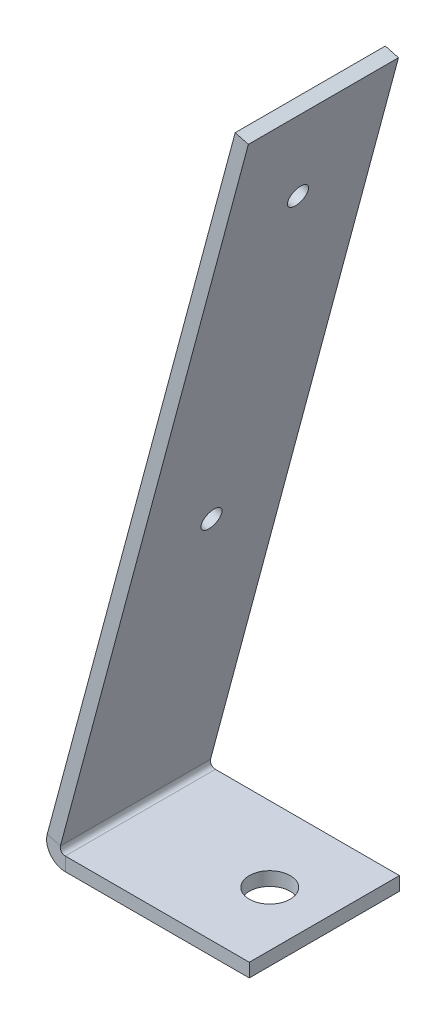
ISO-10303-21;
HEADER;
FILE_DESCRIPTION(('STEP AP214'),'2;1');
FILE_NAME('part.step','',(''),(''),'','','');
FILE_SCHEMA(('AUTOMOTIVE_DESIGN { 1 0 10303 214 1 1 1 1 }'));
ENDSEC;
DATA;
#1=APPLICATION_CONTEXT('core data for automotive mechanical design processes');
#2=APPLICATION_PROTOCOL_DEFINITION('international standard','automotive_design',2000,#1);
#3=PRODUCT_CONTEXT('',#1,'mechanical');
#4=PRODUCT('Part','Part','',(#3));
#5=PRODUCT_RELATED_PRODUCT_CATEGORY('part','',(#4));
#6=PRODUCT_DEFINITION_FORMATION('','',#4);
#7=PRODUCT_DEFINITION_CONTEXT('part definition',#1,'design');
#8=PRODUCT_DEFINITION('design','',#6,#7);
#9=PRODUCT_DEFINITION_SHAPE('','',#8);
#10=(LENGTH_UNIT() NAMED_UNIT(*) SI_UNIT(.MILLI.,.METRE.));
#11=(NAMED_UNIT(*) PLANE_ANGLE_UNIT() SI_UNIT($,.RADIAN.));
#12=(NAMED_UNIT(*) SI_UNIT($,.STERADIAN.) SOLID_ANGLE_UNIT());
#13=UNCERTAINTY_MEASURE_WITH_UNIT(LENGTH_MEASURE(1.E-05),#10,'distance_accuracy_value','');
#14=(GEOMETRIC_REPRESENTATION_CONTEXT(3) GLOBAL_UNCERTAINTY_ASSIGNED_CONTEXT((#13)) GLOBAL_UNIT_ASSIGNED_CONTEXT((#10,
#11,#12)) REPRESENTATION_CONTEXT('',''));
#15=CARTESIAN_POINT('',(0.,0.,0.));
#16=DIRECTION('',(0.,0.,1.));
#17=DIRECTION('',(1.,0.,0.));
#18=AXIS2_PLACEMENT_3D('',#15,#16,#17);
#19=CARTESIAN_POINT('',(0.,-2.,11.));
#20=DIRECTION('',(0.,0.,1.));
#21=DIRECTION('',(1.,0.,0.));
#22=AXIS2_PLACEMENT_3D('',#19,#20,#21);
#23=PLANE('',#22);
#24=DIRECTION('',(1.,0.,0.));
#25=VECTOR('',#24,1.);
#26=CARTESIAN_POINT('',(0.,0.,11.));
#27=LINE('',#26,#25);
#28=CARTESIAN_POINT('',(-26.969491829545,0.,11.));
#29=VERTEX_POINT('',#28);
#30=CARTESIAN_POINT('',(0.,0.,11.));
#31=VERTEX_POINT('',#30);
#32=EDGE_CURVE('E92',#29,#31,#27,.T.);
#33=ORIENTED_EDGE('',*,*,#32,.F.);
#34=DIRECTION('',(0.,-1.,0.));
#35=VECTOR('',#34,1.);
#36=CARTESIAN_POINT('',(-26.969491829545,0.,11.));
#37=LINE('',#36,#35);
#38=CARTESIAN_POINT('',(-26.969491829545,-2.00000000000001,11.));
#39=VERTEX_POINT('',#38);
#40=EDGE_CURVE('E108',#29,#39,#37,.T.);
#41=ORIENTED_EDGE('',*,*,#40,.T.);
#42=DIRECTION('',(1.,0.,0.));
#43=VECTOR('',#42,1.);
#44=CARTESIAN_POINT('',(0.,-2.,11.));
#45=LINE('',#44,#43);
#46=CARTESIAN_POINT('',(0.,-2.,11.));
#47=VERTEX_POINT('',#46);
#48=EDGE_CURVE('E81',#39,#47,#45,.T.);
#49=ORIENTED_EDGE('',*,*,#48,.T.);
#50=DIRECTION('',(0.,1.,0.));
#51=VECTOR('',#50,1.);
#52=CARTESIAN_POINT('',(0.,-2.,11.));
#53=LINE('',#52,#51);
#54=EDGE_CURVE('E13',#47,#31,#53,.T.);
#55=ORIENTED_EDGE('',*,*,#54,.T.);
#56=EDGE_LOOP('',(#33,#41,#49,#55));
#57=FACE_BOUND('',#56,.T.);
#58=ADVANCED_FACE('F58',(#57),#23,.T.);
#59=CARTESIAN_POINT('',(0.,-2.,0.));
#60=DIRECTION('',(0.,1.,0.));
#61=DIRECTION('',(0.,0.,1.));
#62=AXIS2_PLACEMENT_3D('',#59,#60,#61);
#63=PLANE('',#62);
#64=CARTESIAN_POINT('',(-8.,-2.00000000000001,0.));
#65=DIRECTION('',(0.,1.,0.));
#66=DIRECTION('',(0.,0.,1.));
#67=AXIS2_PLACEMENT_3D('',#64,#65,#66);
#68=CIRCLE('',#67,3.);
#69=CARTESIAN_POINT('',(-8.,-2.00000000000001,3.));
#70=VERTEX_POINT('',#69);
#71=EDGE_CURVE('E138',#70,#70,#68,.T.);
#72=ORIENTED_EDGE('',*,*,#71,.T.);
#73=EDGE_LOOP('',(#72));
#74=FACE_BOUND('',#73,.T.);
#75=DIRECTION('',(0.,0.,1.));
#76=VECTOR('',#75,1.);
#77=CARTESIAN_POINT('',(-26.969491829545,-2.00000000000001,11.));
#78=LINE('',#77,#76);
#79=CARTESIAN_POINT('',(-26.969491829545,-2.,-11.));
#80=VERTEX_POINT('',#79);
#81=EDGE_CURVE('E129',#39,#80,#78,.F.);
#82=ORIENTED_EDGE('',*,*,#81,.T.);
#83=DIRECTION('',(-1.,0.,0.));
#84=VECTOR('',#83,1.);
#85=CARTESIAN_POINT('',(0.,-2.,-11.));
#86=LINE('',#85,#84);
#87=CARTESIAN_POINT('',(0.,-2.,-11.));
#88=VERTEX_POINT('',#87);
#89=EDGE_CURVE('E112',#88,#80,#86,.T.);
#90=ORIENTED_EDGE('',*,*,#89,.F.);
#91=DIRECTION('',(0.,0.,-1.));
#92=VECTOR('',#91,1.);
#93=CARTESIAN_POINT('',(0.,-2.,11.));
#94=LINE('',#93,#92);
#95=EDGE_CURVE('E97',#47,#88,#94,.T.);
#96=ORIENTED_EDGE('',*,*,#95,.F.);
#97=ORIENTED_EDGE('',*,*,#48,.F.);
#98=EDGE_LOOP('',(#82,#90,#96,#97));
#99=FACE_BOUND('',#98,.T.);
#100=ADVANCED_FACE('F239',(#74,#99),#63,.F.);
#101=CARTESIAN_POINT('',(0.,0.,0.));
#102=DIRECTION('',(0.,1.,0.));
#103=DIRECTION('',(0.,0.,1.));
#104=AXIS2_PLACEMENT_3D('',#101,#102,#103);
#105=PLANE('',#104);
#106=CARTESIAN_POINT('',(-8.,0.,0.));
#107=DIRECTION('',(0.,1.,0.));
#108=DIRECTION('',(0.,0.,1.));
#109=AXIS2_PLACEMENT_3D('',#106,#107,#108);
#110=CIRCLE('',#109,3.);
#111=CARTESIAN_POINT('',(-8.,0.,3.));
#112=VERTEX_POINT('',#111);
#113=EDGE_CURVE('E172',#112,#112,#110,.T.);
#114=ORIENTED_EDGE('',*,*,#113,.F.);
#115=EDGE_LOOP('',(#114));
#116=FACE_BOUND('',#115,.T.);
#117=DIRECTION('',(-1.,0.,0.));
#118=VECTOR('',#117,1.);
#119=CARTESIAN_POINT('',(0.,0.,-11.));
#120=LINE('',#119,#118);
#121=CARTESIAN_POINT('',(0.,0.,-11.));
#122=VERTEX_POINT('',#121);
#123=CARTESIAN_POINT('',(-26.969491829545,0.,-11.));
#124=VERTEX_POINT('',#123);
#125=EDGE_CURVE('E98',#122,#124,#120,.T.);
#126=ORIENTED_EDGE('',*,*,#125,.T.);
#127=DIRECTION('',(0.,0.,1.));
#128=VECTOR('',#127,1.);
#129=CARTESIAN_POINT('',(-26.969491829545,0.,11.));
#130=LINE('',#129,#128);
#131=EDGE_CURVE('E73',#29,#124,#130,.F.);
#132=ORIENTED_EDGE('',*,*,#131,.F.);
#133=ORIENTED_EDGE('',*,*,#32,.T.);
#134=DIRECTION('',(0.,0.,-1.));
#135=VECTOR('',#134,1.);
#136=CARTESIAN_POINT('',(0.,0.,11.));
#137=LINE('',#136,#135);
#138=EDGE_CURVE('E95',#31,#122,#137,.T.);
#139=ORIENTED_EDGE('',*,*,#138,.T.);
#140=EDGE_LOOP('',(#126,#132,#133,#139));
#141=FACE_BOUND('',#140,.T.);
#142=ADVANCED_FACE('F93',(#116,#141),#105,.T.);
#143=CARTESIAN_POINT('',(0.,-2.,11.));
#144=DIRECTION('',(1.,0.,0.));
#145=DIRECTION('',(0.,0.,-1.));
#146=AXIS2_PLACEMENT_3D('',#143,#144,#145);
#147=PLANE('',#146);
#148=ORIENTED_EDGE('',*,*,#138,.F.);
#149=ORIENTED_EDGE('',*,*,#54,.F.);
#150=ORIENTED_EDGE('',*,*,#95,.T.);
#151=DIRECTION('',(0.,1.,0.));
#152=VECTOR('',#151,1.);
#153=CARTESIAN_POINT('',(0.,-2.,-11.));
#154=LINE('',#153,#152);
#155=EDGE_CURVE('E62',#88,#122,#154,.T.);
#156=ORIENTED_EDGE('',*,*,#155,.T.);
#157=EDGE_LOOP('',(#148,#149,#150,#156));
#158=FACE_BOUND('',#157,.T.);
#159=ADVANCED_FACE('F60',(#158),#147,.T.);
#160=CARTESIAN_POINT('',(0.,-2.,-11.));
#161=DIRECTION('',(0.,0.,-1.));
#162=DIRECTION('',(-1.,0.,0.));
#163=AXIS2_PLACEMENT_3D('',#160,#161,#162);
#164=PLANE('',#163);
#165=DIRECTION('',(0.,-1.,0.));
#166=VECTOR('',#165,1.);
#167=CARTESIAN_POINT('',(-26.969491829545,0.,-11.));
#168=LINE('',#167,#166);
#169=EDGE_CURVE('E104',#124,#80,#168,.T.);
#170=ORIENTED_EDGE('',*,*,#169,.F.);
#171=ORIENTED_EDGE('',*,*,#125,.F.);
#172=ORIENTED_EDGE('',*,*,#155,.F.);
#173=ORIENTED_EDGE('',*,*,#89,.T.);
#174=EDGE_LOOP('',(#170,#171,#172,#173));
#175=FACE_BOUND('',#174,.T.);
#176=ADVANCED_FACE('F241',(#175),#164,.T.);
#177=CARTESIAN_POINT('',(-26.969491829545,0.7366,-11.));
#178=DIRECTION('',(0.,0.,-1.));
#179=DIRECTION('',(0.,1.,0.));
#180=AXIS2_PLACEMENT_3D('',#177,#178,#179);
#181=PLANE('',#180);
#182=DIRECTION('',(0.965925826289069,-0.258819045102518,0.));
#183=VECTOR('',#182,1.);
#184=CARTESIAN_POINT('',(-29.6128444457677,1.44488419882755,-11.));
#185=LINE('',#184,#183);
#186=CARTESIAN_POINT('',(-27.6809927931895,0.927246108622515,-11.));
#187=VERTEX_POINT('',#186);
#188=CARTESIAN_POINT('',(-29.6128444457677,1.44488419882755,-11.));
#189=VERTEX_POINT('',#188);
#190=EDGE_CURVE('E134',#187,#189,#185,.F.);
#191=ORIENTED_EDGE('',*,*,#190,.F.);
#192=CARTESIAN_POINT('',(-26.969491829545,0.7366,-11.));
#193=DIRECTION('',(0.,0.,1.));
#194=DIRECTION('',(0.,-1.,0.));
#195=AXIS2_PLACEMENT_3D('',#192,#193,#194);
#196=CIRCLE('',#195,0.736600000000001);
#197=EDGE_CURVE('E123',#124,#187,#196,.F.);
#198=ORIENTED_EDGE('',*,*,#197,.F.);
#199=ORIENTED_EDGE('',*,*,#169,.T.);
#200=CARTESIAN_POINT('',(-26.969491829545,0.7366,-11.));
#201=DIRECTION('',(0.,0.,1.));
#202=DIRECTION('',(0.,-1.,0.));
#203=AXIS2_PLACEMENT_3D('',#200,#201,#202);
#204=CIRCLE('',#203,2.7366);
#205=EDGE_CURVE('E116',#80,#189,#204,.F.);
#206=ORIENTED_EDGE('',*,*,#205,.T.);
#207=EDGE_LOOP('',(#191,#198,#199,#206));
#208=FACE_BOUND('',#207,.T.);
#209=ADVANCED_FACE('F244',(#208),#181,.T.);
#210=CARTESIAN_POINT('',(-26.969491829545,0.736599999999995,11.));
#211=DIRECTION('',(0.,0.,-1.));
#212=DIRECTION('',(0.,1.,0.));
#213=AXIS2_PLACEMENT_3D('',#210,#211,#212);
#214=PLANE('',#213);
#215=CARTESIAN_POINT('',(-26.969491829545,0.736599999999995,11.));
#216=DIRECTION('',(0.,0.,1.));
#217=DIRECTION('',(0.,-1.,0.));
#218=AXIS2_PLACEMENT_3D('',#215,#216,#217);
#219=CIRCLE('',#218,0.736600000000001);
#220=CARTESIAN_POINT('',(-27.6809927931895,0.92724610862251,11.));
#221=VERTEX_POINT('',#220);
#222=EDGE_CURVE('E118',#221,#29,#219,.T.);
#223=ORIENTED_EDGE('',*,*,#222,.F.);
#224=DIRECTION('',(0.965925826289069,-0.258819045102518,0.));
#225=VECTOR('',#224,1.);
#226=CARTESIAN_POINT('',(-27.6809927931895,0.927246108622509,11.));
#227=LINE('',#226,#225);
#228=CARTESIAN_POINT('',(-29.6128444457677,1.44488419882755,11.));
#229=VERTEX_POINT('',#228);
#230=EDGE_CURVE('E141',#221,#229,#227,.F.);
#231=ORIENTED_EDGE('',*,*,#230,.T.);
#232=CARTESIAN_POINT('',(-26.969491829545,0.736599999999995,11.));
#233=DIRECTION('',(0.,0.,1.));
#234=DIRECTION('',(0.,-1.,0.));
#235=AXIS2_PLACEMENT_3D('',#232,#233,#234);
#236=CIRCLE('',#235,2.7366);
#237=EDGE_CURVE('E126',#229,#39,#236,.T.);
#238=ORIENTED_EDGE('',*,*,#237,.T.);
#239=ORIENTED_EDGE('',*,*,#40,.F.);
#240=EDGE_LOOP('',(#223,#231,#238,#239));
#241=FACE_BOUND('',#240,.T.);
#242=ADVANCED_FACE('F248',(#241),#214,.F.);
#243=CARTESIAN_POINT('',(-26.969491829545,0.736599999999995,11.));
#244=DIRECTION('',(0.,0.,1.));
#245=DIRECTION('',(-0.965925826289069,0.258819045102518,0.));
#246=AXIS2_PLACEMENT_3D('',#243,#244,#245);
#247=CYLINDRICAL_SURFACE('',#246,2.7366);
#248=ORIENTED_EDGE('',*,*,#81,.F.);
#249=ORIENTED_EDGE('',*,*,#237,.F.);
#250=DIRECTION('',(0.,0.,1.));
#251=VECTOR('',#250,1.);
#252=CARTESIAN_POINT('',(-29.6128444457677,1.44488419882755,-11.));
#253=LINE('',#252,#251);
#254=EDGE_CURVE('E144',#229,#189,#253,.F.);
#255=ORIENTED_EDGE('',*,*,#254,.T.);
#256=ORIENTED_EDGE('',*,*,#205,.F.);
#257=EDGE_LOOP('',(#248,#249,#255,#256));
#258=FACE_BOUND('',#257,.T.);
#259=ADVANCED_FACE('F245',(#258),#247,.T.);
#260=CARTESIAN_POINT('',(-26.969491829545,0.736599999999995,11.));
#261=DIRECTION('',(0.,0.,1.));
#262=DIRECTION('',(-0.965925826289069,0.258819045102518,0.));
#263=AXIS2_PLACEMENT_3D('',#260,#261,#262);
#264=CYLINDRICAL_SURFACE('',#263,0.736600000000001);
#265=ORIENTED_EDGE('',*,*,#131,.T.);
#266=ORIENTED_EDGE('',*,*,#197,.T.);
#267=DIRECTION('',(0.,0.,1.));
#268=VECTOR('',#267,1.);
#269=CARTESIAN_POINT('',(-27.6809927931895,0.927246108622513,-11.));
#270=LINE('',#269,#268);
#271=EDGE_CURVE('E137',#187,#221,#270,.T.);
#272=ORIENTED_EDGE('',*,*,#271,.T.);
#273=ORIENTED_EDGE('',*,*,#222,.T.);
#274=EDGE_LOOP('',(#265,#266,#272,#273));
#275=FACE_BOUND('',#274,.T.);
#276=ADVANCED_FACE('F247',(#275),#264,.F.);
#277=CARTESIAN_POINT('',(-2.06580342358527,104.251840891798,11.));
#278=DIRECTION('',(0.,0.,-1.));
#279=DIRECTION('',(-1.,0.,0.));
#280=AXIS2_PLACEMENT_3D('',#277,#278,#279);
#281=PLANE('',#280);
#282=ORIENTED_EDGE('',*,*,#230,.F.);
#283=DIRECTION('',(-0.258819045102518,-0.965925826289069,0.));
#284=VECTOR('',#283,1.);
#285=CARTESIAN_POINT('',(-0.133951771007131,103.734202801593,11.));
#286=LINE('',#285,#284);
#287=CARTESIAN_POINT('',(-0.13395177100713,103.734202801593,11.));
#288=VERTEX_POINT('',#287);
#289=EDGE_CURVE('E147',#221,#288,#286,.F.);
#290=ORIENTED_EDGE('',*,*,#289,.T.);
#291=DIRECTION('',(0.965925826289069,-0.258819045102518,0.));
#292=VECTOR('',#291,1.);
#293=CARTESIAN_POINT('',(-2.06580342358527,104.251840891798,11.));
#294=LINE('',#293,#292);
#295=CARTESIAN_POINT('',(-2.06580342358527,104.251840891798,11.));
#296=VERTEX_POINT('',#295);
#297=EDGE_CURVE('E121',#296,#288,#294,.T.);
#298=ORIENTED_EDGE('',*,*,#297,.F.);
#299=DIRECTION('',(0.258819045102518,0.965925826289069,0.));
#300=VECTOR('',#299,1.);
#301=CARTESIAN_POINT('',(-27.8516803485246,8.01763809020496,11.));
#302=LINE('',#301,#300);
#303=EDGE_CURVE('E156',#229,#296,#302,.T.);
#304=ORIENTED_EDGE('',*,*,#303,.F.);
#305=EDGE_LOOP('',(#282,#290,#298,#304));
#306=FACE_BOUND('',#305,.T.);
#307=ADVANCED_FACE('F212',(#306),#281,.F.);
#308=CARTESIAN_POINT('',(-29.861299291758,0.517638090205035,-11.));
#309=DIRECTION('',(0.,0.,1.));
#310=DIRECTION('',(1.,0.,0.));
#311=AXIS2_PLACEMENT_3D('',#308,#309,#310);
#312=PLANE('',#311);
#313=ORIENTED_EDGE('',*,*,#190,.T.);
#314=DIRECTION('',(-0.258819045102518,-0.965925826289069,0.));
#315=VECTOR('',#314,1.);
#316=CARTESIAN_POINT('',(-27.8516803485246,8.01763809020496,-11.));
#317=LINE('',#316,#315);
#318=CARTESIAN_POINT('',(-2.06580342358527,104.251840891798,-11.));
#319=VERTEX_POINT('',#318);
#320=EDGE_CURVE('E162',#319,#189,#317,.T.);
#321=ORIENTED_EDGE('',*,*,#320,.F.);
#322=DIRECTION('',(0.965925826289069,-0.258819045102518,0.));
#323=VECTOR('',#322,1.);
#324=CARTESIAN_POINT('',(-2.06580342358527,104.251840891798,-11.));
#325=LINE('',#324,#323);
#326=CARTESIAN_POINT('',(-0.13395177100713,103.734202801593,-11.));
#327=VERTEX_POINT('',#326);
#328=EDGE_CURVE('E165',#319,#327,#325,.T.);
#329=ORIENTED_EDGE('',*,*,#328,.T.);
#330=DIRECTION('',(0.258819045102518,0.965925826289069,0.));
#331=VECTOR('',#330,1.);
#332=CARTESIAN_POINT('',(-27.9294476391798,0.,-11.));
#333=LINE('',#332,#331);
#334=EDGE_CURVE('E153',#327,#187,#333,.F.);
#335=ORIENTED_EDGE('',*,*,#334,.T.);
#336=EDGE_LOOP('',(#313,#321,#329,#335));
#337=FACE_BOUND('',#336,.T.);
#338=ADVANCED_FACE('F194',(#337),#312,.F.);
#339=CARTESIAN_POINT('',(-27.8516803485246,8.01763809020496,0.));
#340=DIRECTION('',(0.965925826289069,-0.258819045102518,0.));
#341=DIRECTION('',(0.258819045102518,0.965925826289069,0.));
#342=AXIS2_PLACEMENT_3D('',#339,#340,#341);
#343=PLANE('',#342);
#344=CARTESIAN_POINT('',(-5.79279767306154,90.342508993235,0.));
#345=DIRECTION('',(-0.965925826289069,0.258819045102518,0.));
#346=DIRECTION('',(-0.258819045102518,-0.965925826289069,0.));
#347=AXIS2_PLACEMENT_3D('',#344,#345,#346);
#348=CIRCLE('',#347,1.5);
#349=CARTESIAN_POINT('',(-6.18102624071531,88.8936202538014,0.));
#350=VERTEX_POINT('',#349);
#351=EDGE_CURVE('E184',#350,#350,#348,.T.);
#352=ORIENTED_EDGE('',*,*,#351,.F.);
#353=EDGE_LOOP('',(#352));
#354=FACE_BOUND('',#353,.T.);
#355=CARTESIAN_POINT('',(-18.4749308830849,43.0121435050706,0.));
#356=DIRECTION('',(-0.965925826289069,0.258819045102518,0.));
#357=DIRECTION('',(-0.258819045102518,-0.965925826289069,0.));
#358=AXIS2_PLACEMENT_3D('',#355,#356,#357);
#359=CIRCLE('',#358,1.5);
#360=CARTESIAN_POINT('',(-18.8631594507387,41.563254765637,0.));
#361=VERTEX_POINT('',#360);
#362=EDGE_CURVE('E178',#361,#361,#359,.T.);
#363=ORIENTED_EDGE('',*,*,#362,.F.);
#364=EDGE_LOOP('',(#363));
#365=FACE_BOUND('',#364,.T.);
#366=ORIENTED_EDGE('',*,*,#254,.F.);
#367=ORIENTED_EDGE('',*,*,#303,.T.);
#368=DIRECTION('',(0.,0.,-1.));
#369=VECTOR('',#368,1.);
#370=CARTESIAN_POINT('',(-2.06580342358527,104.251840891798,0.));
#371=LINE('',#370,#369);
#372=EDGE_CURVE('E159',#296,#319,#371,.T.);
#373=ORIENTED_EDGE('',*,*,#372,.T.);
#374=ORIENTED_EDGE('',*,*,#320,.T.);
#375=EDGE_LOOP('',(#366,#367,#373,#374));
#376=FACE_BOUND('',#375,.T.);
#377=ADVANCED_FACE('F190',(#354,#365,#376),#343,.F.);
#378=CARTESIAN_POINT('',(-25.9198286959465,7.49999999999993,0.));
#379=DIRECTION('',(0.965925826289069,-0.258819045102518,0.));
#380=DIRECTION('',(0.258819045102518,0.965925826289069,0.));
#381=AXIS2_PLACEMENT_3D('',#378,#379,#380);
#382=PLANE('',#381);
#383=CARTESIAN_POINT('',(-3.86094602048338,89.82487090303,0.));
#384=DIRECTION('',(0.965925826289069,-0.258819045102518,0.));
#385=DIRECTION('',(0.258819045102518,0.965925826289069,0.));
#386=AXIS2_PLACEMENT_3D('',#383,#384,#385);
#387=CIRCLE('',#386,1.5);
#388=CARTESIAN_POINT('',(-3.47271745282961,91.2737596424636,0.));
#389=VERTEX_POINT('',#388);
#390=EDGE_CURVE('E181',#389,#389,#387,.T.);
#391=ORIENTED_EDGE('',*,*,#390,.F.);
#392=EDGE_LOOP('',(#391));
#393=FACE_BOUND('',#392,.T.);
#394=CARTESIAN_POINT('',(-16.5430792305068,42.4945054148656,0.));
#395=DIRECTION('',(0.965925826289069,-0.258819045102518,0.));
#396=DIRECTION('',(0.258819045102518,0.965925826289069,0.));
#397=AXIS2_PLACEMENT_3D('',#394,#395,#396);
#398=CIRCLE('',#397,1.5);
#399=CARTESIAN_POINT('',(-16.154850662853,43.9433941542992,0.));
#400=VERTEX_POINT('',#399);
#401=EDGE_CURVE('E175',#400,#400,#398,.T.);
#402=ORIENTED_EDGE('',*,*,#401,.F.);
#403=EDGE_LOOP('',(#402));
#404=FACE_BOUND('',#403,.T.);
#405=ORIENTED_EDGE('',*,*,#289,.F.);
#406=ORIENTED_EDGE('',*,*,#271,.F.);
#407=ORIENTED_EDGE('',*,*,#334,.F.);
#408=DIRECTION('',(0.,0.,1.));
#409=VECTOR('',#408,1.);
#410=CARTESIAN_POINT('',(-0.133951771007134,103.734202801593,-11.));
#411=LINE('',#410,#409);
#412=EDGE_CURVE('E150',#288,#327,#411,.F.);
#413=ORIENTED_EDGE('',*,*,#412,.F.);
#414=EDGE_LOOP('',(#405,#406,#407,#413));
#415=FACE_BOUND('',#414,.T.);
#416=ADVANCED_FACE('F193',(#393,#404,#415),#382,.T.);
#417=CARTESIAN_POINT('',(-2.06580342358527,104.251840891798,-11.));
#418=DIRECTION('',(-0.258819045102518,-0.965925826289069,0.));
#419=DIRECTION('',(0.965925826289069,-0.258819045102518,0.));
#420=AXIS2_PLACEMENT_3D('',#417,#418,#419);
#421=PLANE('',#420);
#422=ORIENTED_EDGE('',*,*,#412,.T.);
#423=ORIENTED_EDGE('',*,*,#328,.F.);
#424=ORIENTED_EDGE('',*,*,#372,.F.);
#425=ORIENTED_EDGE('',*,*,#297,.T.);
#426=EDGE_LOOP('',(#422,#423,#424,#425));
#427=FACE_BOUND('',#426,.T.);
#428=ADVANCED_FACE('F222',(#427),#421,.F.);
#429=CARTESIAN_POINT('',(-8.,0.,0.));
#430=DIRECTION('',(0.,1.,0.));
#431=DIRECTION('',(0.,0.,1.));
#432=AXIS2_PLACEMENT_3D('',#429,#430,#431);
#433=CYLINDRICAL_SURFACE('',#432,3.);
#434=ORIENTED_EDGE('',*,*,#71,.F.);
#435=EDGE_LOOP('',(#434));
#436=FACE_BOUND('',#435,.T.);
#437=ORIENTED_EDGE('',*,*,#113,.T.);
#438=EDGE_LOOP('',(#437));
#439=FACE_BOUND('',#438,.T.);
#440=ADVANCED_FACE('F281',(#436,#439),#433,.F.);
#441=CARTESIAN_POINT('',(-18.4749308830849,43.0121435050706,0.));
#442=DIRECTION('',(-0.965925826289069,0.258819045102518,0.));
#443=DIRECTION('',(-0.258819045102518,-0.965925826289069,0.));
#444=AXIS2_PLACEMENT_3D('',#441,#442,#443);
#445=CYLINDRICAL_SURFACE('',#444,1.5);
#446=ORIENTED_EDGE('',*,*,#401,.T.);
#447=EDGE_LOOP('',(#446));
#448=FACE_BOUND('',#447,.T.);
#449=ORIENTED_EDGE('',*,*,#362,.T.);
#450=EDGE_LOOP('',(#449));
#451=FACE_BOUND('',#450,.T.);
#452=ADVANCED_FACE('F283',(#448,#451),#445,.F.);
#453=CARTESIAN_POINT('',(-5.79279767306154,90.342508993235,0.));
#454=DIRECTION('',(-0.965925826289069,0.258819045102518,0.));
#455=DIRECTION('',(-0.258819045102518,-0.965925826289069,0.));
#456=AXIS2_PLACEMENT_3D('',#453,#454,#455);
#457=CYLINDRICAL_SURFACE('',#456,1.5);
#458=ORIENTED_EDGE('',*,*,#390,.T.);
#459=EDGE_LOOP('',(#458));
#460=FACE_BOUND('',#459,.T.);
#461=ORIENTED_EDGE('',*,*,#351,.T.);
#462=EDGE_LOOP('',(#461));
#463=FACE_BOUND('',#462,.T.);
#464=ADVANCED_FACE('F188',(#460,#463),#457,.F.);
#465=CLOSED_SHELL('',(#58,#100,#142,#159,#176,#209,#242,#259,#276,#307,#338,#377,#416,#428,#440,
#452,#464));
#466=MANIFOLD_SOLID_BREP('B2',#465);
#467=ADVANCED_BREP_SHAPE_REPRESENTATION('',(#18,#466),#14);
#468=SHAPE_DEFINITION_REPRESENTATION(#9,#467);
ENDSEC;
END-ISO-10303-21;
